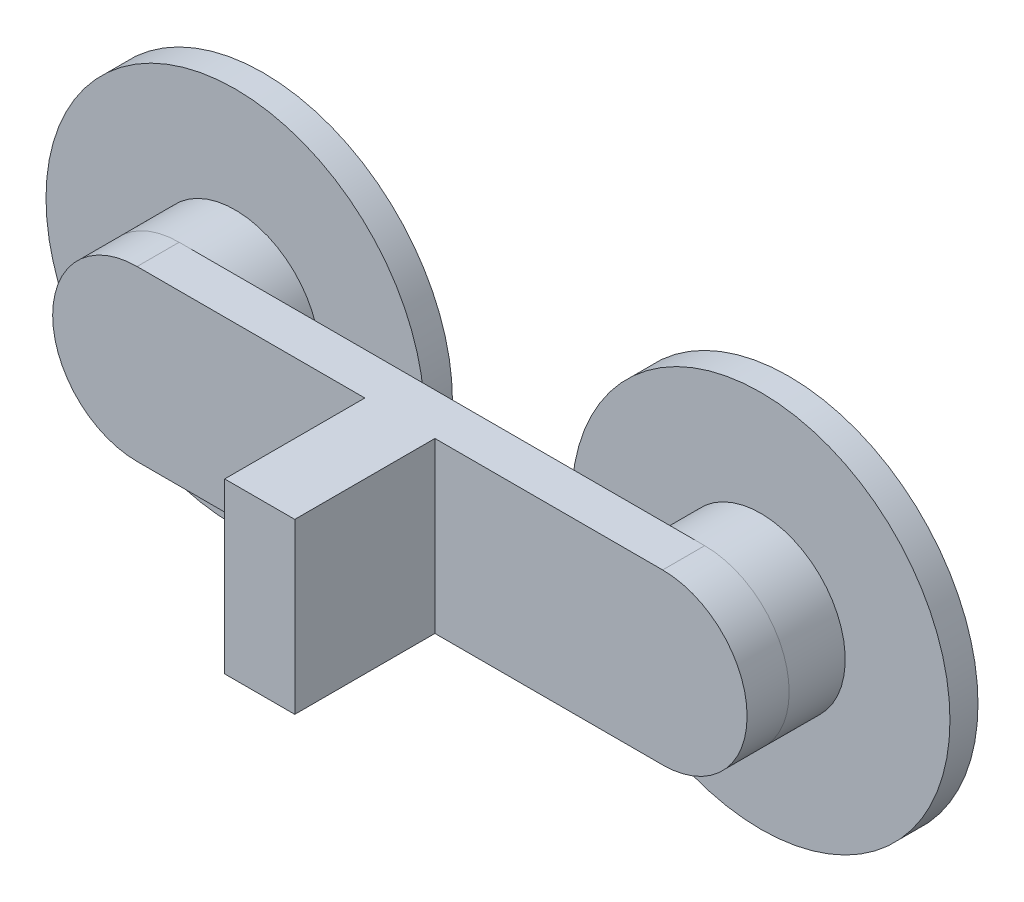
ISO-10303-21;
HEADER;
FILE_DESCRIPTION(('STEP AP214'),'2;1');
FILE_NAME('part.step','',(''),(''),'','','');
FILE_SCHEMA(('AUTOMOTIVE_DESIGN { 1 0 10303 214 1 1 1 1 }'));
ENDSEC;
DATA;
#1=APPLICATION_CONTEXT('core data for automotive mechanical design processes');
#2=APPLICATION_PROTOCOL_DEFINITION('international standard','automotive_design',2000,#1);
#3=PRODUCT_CONTEXT('',#1,'mechanical');
#4=PRODUCT('Part','Part','',(#3));
#5=PRODUCT_RELATED_PRODUCT_CATEGORY('part','',(#4));
#6=PRODUCT_DEFINITION_FORMATION('','',#4);
#7=PRODUCT_DEFINITION_CONTEXT('part definition',#1,'design');
#8=PRODUCT_DEFINITION('design','',#6,#7);
#9=PRODUCT_DEFINITION_SHAPE('','',#8);
#10=(LENGTH_UNIT() NAMED_UNIT(*) SI_UNIT(.MILLI.,.METRE.));
#11=(NAMED_UNIT(*) PLANE_ANGLE_UNIT() SI_UNIT($,.RADIAN.));
#12=(NAMED_UNIT(*) SI_UNIT($,.STERADIAN.) SOLID_ANGLE_UNIT());
#13=UNCERTAINTY_MEASURE_WITH_UNIT(LENGTH_MEASURE(1.E-05),#10,'distance_accuracy_value','');
#14=(GEOMETRIC_REPRESENTATION_CONTEXT(3) GLOBAL_UNCERTAINTY_ASSIGNED_CONTEXT((#13)) GLOBAL_UNIT_ASSIGNED_CONTEXT((#10,
#11,#12)) REPRESENTATION_CONTEXT('',''));
#15=CARTESIAN_POINT('',(0.,0.,0.));
#16=DIRECTION('',(0.,0.,1.));
#17=DIRECTION('',(1.,0.,0.));
#18=AXIS2_PLACEMENT_3D('',#15,#16,#17);
#19=CARTESIAN_POINT('',(-19.6186326528947,7.98455670782044,36.4303436753045));
#20=DIRECTION('',(0.,0.,1.));
#21=DIRECTION('',(1.,0.,0.));
#22=AXIS2_PLACEMENT_3D('',#19,#20,#21);
#23=PLANE('',#22);
#24=CARTESIAN_POINT('',(-19.6186326528947,7.98455670782044,36.4303436753045));
#25=DIRECTION('',(0.,0.,1.));
#26=DIRECTION('',(1.,0.,0.));
#27=AXIS2_PLACEMENT_3D('',#24,#25,#26);
#28=CIRCLE('',#27,6.025);
#29=CARTESIAN_POINT('',(-13.5936326528947,7.98455670782044,36.4303436753045));
#30=VERTEX_POINT('',#29);
#31=EDGE_CURVE('P0_E10',#30,#30,#28,.T.);
#32=ORIENTED_EDGE('',*,*,#31,.T.);
#33=EDGE_LOOP('',(#32));
#34=FACE_BOUND('',#33,.T.);
#35=ADVANCED_FACE('P0_F15',(#34),#23,.T.);
#36=CARTESIAN_POINT('',(-19.6186326528947,7.98455670782044,36.4303436753045));
#37=DIRECTION('',(0.,0.,-1.));
#38=DIRECTION('',(-1.,0.,0.));
#39=AXIS2_PLACEMENT_3D('',#36,#37,#38);
#40=CYLINDRICAL_SURFACE('',#39,6.025);
#41=ORIENTED_EDGE('',*,*,#31,.F.);
#42=EDGE_LOOP('',(#41));
#43=FACE_BOUND('',#42,.T.);
#44=CARTESIAN_POINT('',(-19.6186326528947,7.98455670782044,32.4303436753045));
#45=DIRECTION('',(0.,0.,-1.));
#46=DIRECTION('',(-1.,0.,0.));
#47=AXIS2_PLACEMENT_3D('',#44,#45,#46);
#48=CIRCLE('',#47,6.025);
#49=CARTESIAN_POINT('',(-25.6436326528947,7.98455670782044,32.4303436753045));
#50=VERTEX_POINT('',#49);
#51=EDGE_CURVE('P0_E22',#50,#50,#48,.T.);
#52=ORIENTED_EDGE('',*,*,#51,.F.);
#53=EDGE_LOOP('',(#52));
#54=FACE_BOUND('',#53,.T.);
#55=ADVANCED_FACE('P0_F57',(#43,#54),#40,.T.);
#56=CARTESIAN_POINT('',(-19.6186326528947,7.98455670782044,32.4303436753045));
#57=DIRECTION('',(0.,0.,-1.));
#58=DIRECTION('',(-1.,0.,0.));
#59=AXIS2_PLACEMENT_3D('',#56,#57,#58);
#60=CYLINDRICAL_SURFACE('',#59,13.5);
#61=CARTESIAN_POINT('',(-19.6186326528947,7.98455670782044,32.4303436753045));
#62=DIRECTION('',(0.,0.,-1.));
#63=DIRECTION('',(-1.,0.,0.));
#64=AXIS2_PLACEMENT_3D('',#61,#62,#63);
#65=CIRCLE('',#64,13.5);
#66=CARTESIAN_POINT('',(-33.1186326528947,7.98455670782044,32.4303436753045));
#67=VERTEX_POINT('',#66);
#68=EDGE_CURVE('P0_E26',#67,#67,#65,.T.);
#69=ORIENTED_EDGE('',*,*,#68,.T.);
#70=EDGE_LOOP('',(#69));
#71=FACE_BOUND('',#70,.T.);
#72=CARTESIAN_POINT('',(-19.6186326528947,7.98455670782044,30.4303436753045));
#73=DIRECTION('',(0.,0.,-1.));
#74=DIRECTION('',(-1.,0.,0.));
#75=AXIS2_PLACEMENT_3D('',#72,#73,#74);
#76=CIRCLE('',#75,13.5);
#77=CARTESIAN_POINT('',(-33.1186326528947,7.98455670782044,30.4303436753045));
#78=VERTEX_POINT('',#77);
#79=EDGE_CURVE('P0_E30',#78,#78,#76,.T.);
#80=ORIENTED_EDGE('',*,*,#79,.F.);
#81=EDGE_LOOP('',(#80));
#82=FACE_BOUND('',#81,.T.);
#83=ADVANCED_FACE('P0_F55',(#71,#82),#60,.T.);
#84=CARTESIAN_POINT('',(-19.6186326528947,7.98455670782044,32.4303436753045));
#85=DIRECTION('',(0.,0.,-1.));
#86=DIRECTION('',(-1.,0.,0.));
#87=AXIS2_PLACEMENT_3D('',#84,#85,#86);
#88=PLANE('',#87);
#89=ORIENTED_EDGE('',*,*,#51,.T.);
#90=EDGE_LOOP('',(#89));
#91=FACE_BOUND('',#90,.T.);
#92=ORIENTED_EDGE('',*,*,#68,.F.);
#93=EDGE_LOOP('',(#92));
#94=FACE_BOUND('',#93,.T.);
#95=ADVANCED_FACE('P0_F52',(#91,#94),#88,.F.);
#96=CARTESIAN_POINT('',(-19.6186326528947,7.98455670782044,30.4303436753045));
#97=DIRECTION('',(0.,0.,1.));
#98=DIRECTION('',(1.,0.,0.));
#99=AXIS2_PLACEMENT_3D('',#96,#97,#98);
#100=PLANE('',#99);
#101=CARTESIAN_POINT('',(-19.6186326528947,7.98455670782044,30.4303436753045));
#102=DIRECTION('',(0.,0.,-1.));
#103=DIRECTION('',(-1.,0.,0.));
#104=AXIS2_PLACEMENT_3D('',#101,#102,#103);
#105=CIRCLE('',#104,4.005);
#106=CARTESIAN_POINT('',(-23.6236326528947,7.98455670782044,30.4303436753045));
#107=VERTEX_POINT('',#106);
#108=EDGE_CURVE('P0_E36',#107,#107,#105,.T.);
#109=ORIENTED_EDGE('',*,*,#108,.F.);
#110=EDGE_LOOP('',(#109));
#111=FACE_BOUND('',#110,.T.);
#112=ORIENTED_EDGE('',*,*,#79,.T.);
#113=EDGE_LOOP('',(#112));
#114=FACE_BOUND('',#113,.T.);
#115=ADVANCED_FACE('P0_F17',(#111,#114),#100,.F.);
#116=CARTESIAN_POINT('',(-19.6186326528947,7.98455670782044,34.4303436753045));
#117=DIRECTION('',(0.,0.,-1.));
#118=DIRECTION('',(-1.,0.,0.));
#119=AXIS2_PLACEMENT_3D('',#116,#117,#118);
#120=CYLINDRICAL_SURFACE('',#119,4.005);
#121=CARTESIAN_POINT('',(-19.6186326528947,7.98455670782044,34.4303436753045));
#122=DIRECTION('',(0.,0.,-1.));
#123=DIRECTION('',(-1.,0.,0.));
#124=AXIS2_PLACEMENT_3D('',#121,#122,#123);
#125=CIRCLE('',#124,4.005);
#126=CARTESIAN_POINT('',(-23.6236326528947,7.98455670782044,34.4303436753045));
#127=VERTEX_POINT('',#126);
#128=EDGE_CURVE('P0_E34',#127,#127,#125,.T.);
#129=ORIENTED_EDGE('',*,*,#128,.F.);
#130=EDGE_LOOP('',(#129));
#131=FACE_BOUND('',#130,.T.);
#132=ORIENTED_EDGE('',*,*,#108,.T.);
#133=EDGE_LOOP('',(#132));
#134=FACE_BOUND('',#133,.T.);
#135=ADVANCED_FACE('P0_F44',(#131,#134),#120,.F.);
#136=CARTESIAN_POINT('',(-19.6186326528947,7.98455670782044,34.4303436753045));
#137=DIRECTION('',(0.,0.,-1.));
#138=DIRECTION('',(-1.,0.,0.));
#139=AXIS2_PLACEMENT_3D('',#136,#137,#138);
#140=PLANE('',#139);
#141=ORIENTED_EDGE('',*,*,#128,.T.);
#142=EDGE_LOOP('',(#141));
#143=FACE_BOUND('',#142,.T.);
#144=ADVANCED_FACE('P0_F42',(#143),#140,.T.);
#145=CLOSED_SHELL('',(#35,#55,#83,#95,#115,#135,#144));
#146=MANIFOLD_SOLID_BREP('P0_B1',#145);
#147=CARTESIAN_POINT('',(17.8813673471054,7.9845567078203,36.4303436753045));
#148=DIRECTION('',(0.,0.,1.));
#149=DIRECTION('',(1.,0.,0.));
#150=AXIS2_PLACEMENT_3D('',#147,#148,#149);
#151=PLANE('',#150);
#152=CARTESIAN_POINT('',(17.8813673471054,7.9845567078203,36.4303436753045));
#153=DIRECTION('',(0.,0.,1.));
#154=DIRECTION('',(1.,0.,0.));
#155=AXIS2_PLACEMENT_3D('',#152,#153,#154);
#156=CIRCLE('',#155,6.025);
#157=CARTESIAN_POINT('',(23.9063673471054,7.9845567078203,36.4303436753045));
#158=VERTEX_POINT('',#157);
#159=EDGE_CURVE('P1_E10',#158,#158,#156,.T.);
#160=ORIENTED_EDGE('',*,*,#159,.T.);
#161=EDGE_LOOP('',(#160));
#162=FACE_BOUND('',#161,.T.);
#163=ADVANCED_FACE('P1_F15',(#162),#151,.T.);
#164=CARTESIAN_POINT('',(17.8813673471054,7.9845567078203,36.4303436753045));
#165=DIRECTION('',(0.,0.,-1.));
#166=DIRECTION('',(-1.,0.,0.));
#167=AXIS2_PLACEMENT_3D('',#164,#165,#166);
#168=CYLINDRICAL_SURFACE('',#167,6.025);
#169=ORIENTED_EDGE('',*,*,#159,.F.);
#170=EDGE_LOOP('',(#169));
#171=FACE_BOUND('',#170,.T.);
#172=CARTESIAN_POINT('',(17.8813673471054,7.9845567078203,32.4303436753045));
#173=DIRECTION('',(0.,0.,-1.));
#174=DIRECTION('',(-1.,0.,0.));
#175=AXIS2_PLACEMENT_3D('',#172,#173,#174);
#176=CIRCLE('',#175,6.025);
#177=CARTESIAN_POINT('',(11.8563673471054,7.9845567078203,32.4303436753045));
#178=VERTEX_POINT('',#177);
#179=EDGE_CURVE('P1_E22',#178,#178,#176,.T.);
#180=ORIENTED_EDGE('',*,*,#179,.F.);
#181=EDGE_LOOP('',(#180));
#182=FACE_BOUND('',#181,.T.);
#183=ADVANCED_FACE('P1_F57',(#171,#182),#168,.T.);
#184=CARTESIAN_POINT('',(17.8813673471054,7.9845567078203,32.4303436753045));
#185=DIRECTION('',(0.,0.,-1.));
#186=DIRECTION('',(-1.,0.,0.));
#187=AXIS2_PLACEMENT_3D('',#184,#185,#186);
#188=CYLINDRICAL_SURFACE('',#187,13.5);
#189=CARTESIAN_POINT('',(17.8813673471054,7.9845567078203,32.4303436753045));
#190=DIRECTION('',(0.,0.,-1.));
#191=DIRECTION('',(-1.,0.,0.));
#192=AXIS2_PLACEMENT_3D('',#189,#190,#191);
#193=CIRCLE('',#192,13.5);
#194=CARTESIAN_POINT('',(4.38136734710541,7.9845567078203,32.4303436753045));
#195=VERTEX_POINT('',#194);
#196=EDGE_CURVE('P1_E26',#195,#195,#193,.T.);
#197=ORIENTED_EDGE('',*,*,#196,.T.);
#198=EDGE_LOOP('',(#197));
#199=FACE_BOUND('',#198,.T.);
#200=CARTESIAN_POINT('',(17.8813673471054,7.9845567078203,30.4303436753045));
#201=DIRECTION('',(0.,0.,-1.));
#202=DIRECTION('',(-1.,0.,0.));
#203=AXIS2_PLACEMENT_3D('',#200,#201,#202);
#204=CIRCLE('',#203,13.5);
#205=CARTESIAN_POINT('',(4.38136734710541,7.9845567078203,30.4303436753045));
#206=VERTEX_POINT('',#205);
#207=EDGE_CURVE('P1_E30',#206,#206,#204,.T.);
#208=ORIENTED_EDGE('',*,*,#207,.F.);
#209=EDGE_LOOP('',(#208));
#210=FACE_BOUND('',#209,.T.);
#211=ADVANCED_FACE('P1_F55',(#199,#210),#188,.T.);
#212=CARTESIAN_POINT('',(17.8813673471054,7.9845567078203,32.4303436753045));
#213=DIRECTION('',(0.,0.,-1.));
#214=DIRECTION('',(-1.,0.,0.));
#215=AXIS2_PLACEMENT_3D('',#212,#213,#214);
#216=PLANE('',#215);
#217=ORIENTED_EDGE('',*,*,#179,.T.);
#218=EDGE_LOOP('',(#217));
#219=FACE_BOUND('',#218,.T.);
#220=ORIENTED_EDGE('',*,*,#196,.F.);
#221=EDGE_LOOP('',(#220));
#222=FACE_BOUND('',#221,.T.);
#223=ADVANCED_FACE('P1_F52',(#219,#222),#216,.F.);
#224=CARTESIAN_POINT('',(17.8813673471054,7.9845567078203,30.4303436753045));
#225=DIRECTION('',(0.,0.,1.));
#226=DIRECTION('',(1.,0.,0.));
#227=AXIS2_PLACEMENT_3D('',#224,#225,#226);
#228=PLANE('',#227);
#229=CARTESIAN_POINT('',(17.8813673471054,7.9845567078203,30.4303436753045));
#230=DIRECTION('',(0.,0.,-1.));
#231=DIRECTION('',(-1.,0.,0.));
#232=AXIS2_PLACEMENT_3D('',#229,#230,#231);
#233=CIRCLE('',#232,4.005);
#234=CARTESIAN_POINT('',(13.8763673471054,7.9845567078203,30.4303436753045));
#235=VERTEX_POINT('',#234);
#236=EDGE_CURVE('P1_E36',#235,#235,#233,.T.);
#237=ORIENTED_EDGE('',*,*,#236,.F.);
#238=EDGE_LOOP('',(#237));
#239=FACE_BOUND('',#238,.T.);
#240=ORIENTED_EDGE('',*,*,#207,.T.);
#241=EDGE_LOOP('',(#240));
#242=FACE_BOUND('',#241,.T.);
#243=ADVANCED_FACE('P1_F17',(#239,#242),#228,.F.);
#244=CARTESIAN_POINT('',(17.8813673471054,7.9845567078203,34.4303436753045));
#245=DIRECTION('',(0.,0.,-1.));
#246=DIRECTION('',(-1.,0.,0.));
#247=AXIS2_PLACEMENT_3D('',#244,#245,#246);
#248=CYLINDRICAL_SURFACE('',#247,4.005);
#249=CARTESIAN_POINT('',(17.8813673471054,7.9845567078203,34.4303436753045));
#250=DIRECTION('',(0.,0.,-1.));
#251=DIRECTION('',(-1.,0.,0.));
#252=AXIS2_PLACEMENT_3D('',#249,#250,#251);
#253=CIRCLE('',#252,4.005);
#254=CARTESIAN_POINT('',(13.8763673471054,7.9845567078203,34.4303436753045));
#255=VERTEX_POINT('',#254);
#256=EDGE_CURVE('P1_E34',#255,#255,#253,.T.);
#257=ORIENTED_EDGE('',*,*,#256,.F.);
#258=EDGE_LOOP('',(#257));
#259=FACE_BOUND('',#258,.T.);
#260=ORIENTED_EDGE('',*,*,#236,.T.);
#261=EDGE_LOOP('',(#260));
#262=FACE_BOUND('',#261,.T.);
#263=ADVANCED_FACE('P1_F44',(#259,#262),#248,.F.);
#264=CARTESIAN_POINT('',(17.8813673471054,7.9845567078203,34.4303436753045));
#265=DIRECTION('',(0.,0.,-1.));
#266=DIRECTION('',(-1.,0.,0.));
#267=AXIS2_PLACEMENT_3D('',#264,#265,#266);
#268=PLANE('',#267);
#269=ORIENTED_EDGE('',*,*,#256,.T.);
#270=EDGE_LOOP('',(#269));
#271=FACE_BOUND('',#270,.T.);
#272=ADVANCED_FACE('P1_F42',(#271),#268,.T.);
#273=CLOSED_SHELL('',(#163,#183,#211,#223,#243,#263,#272));
#274=MANIFOLD_SOLID_BREP('P1_B1',#273);
#275=CARTESIAN_POINT('',(-19.6186326528947,7.98455670782044,39.4303436753045));
#276=DIRECTION('',(0.,0.,1.));
#277=DIRECTION('',(1.,0.,0.));
#278=AXIS2_PLACEMENT_3D('',#275,#276,#277);
#279=PLANE('',#278);
#280=DIRECTION('',(0.,-1.,0.));
#281=VECTOR('',#280,1.);
#282=CARTESIAN_POINT('',(-3.36863265289466,14.0095567078204,39.4303436753045));
#283=LINE('',#282,#281);
#284=CARTESIAN_POINT('',(-3.36863265289466,14.0095567078204,39.4303436753045));
#285=VERTEX_POINT('',#284);
#286=CARTESIAN_POINT('',(-3.36863265289466,1.95955670782044,39.4303436753045));
#287=VERTEX_POINT('',#286);
#288=EDGE_CURVE('P2_E31',#285,#287,#283,.T.);
#289=ORIENTED_EDGE('',*,*,#288,.F.);
#290=DIRECTION('',(-1.,0.,0.));
#291=VECTOR('',#290,1.);
#292=CARTESIAN_POINT('',(-19.6186326528947,14.0095567078204,39.4303436753045));
#293=LINE('',#292,#291);
#294=CARTESIAN_POINT('',(-19.6186326528947,14.0095567078204,39.4303436753045));
#295=VERTEX_POINT('',#294);
#296=EDGE_CURVE('P2_E120',#285,#295,#293,.T.);
#297=ORIENTED_EDGE('',*,*,#296,.T.);
#298=CARTESIAN_POINT('',(-19.6186326528947,7.98455670782044,39.4303436753045));
#299=DIRECTION('',(0.,0.,1.));
#300=DIRECTION('',(1.,0.,0.));
#301=AXIS2_PLACEMENT_3D('',#298,#299,#300);
#302=CIRCLE('',#301,6.025);
#303=CARTESIAN_POINT('',(-19.6186326528947,1.95955670782044,39.4303436753045));
#304=VERTEX_POINT('',#303);
#305=EDGE_CURVE('P2_E111',#295,#304,#302,.T.);
#306=ORIENTED_EDGE('',*,*,#305,.T.);
#307=DIRECTION('',(1.,0.,0.));
#308=VECTOR('',#307,1.);
#309=CARTESIAN_POINT('',(-19.6186326528947,1.95955670782044,39.4303436753045));
#310=LINE('',#309,#308);
#311=EDGE_CURVE('P2_E116',#304,#287,#310,.T.);
#312=ORIENTED_EDGE('',*,*,#311,.T.);
#313=EDGE_LOOP('',(#289,#297,#306,#312));
#314=FACE_BOUND('',#313,.T.);
#315=ADVANCED_FACE('P2_F16',(#314),#279,.T.);
#316=CARTESIAN_POINT('',(-19.6186326528947,7.98455670782044,39.4303436753045));
#317=DIRECTION('',(0.,0.,-1.));
#318=DIRECTION('',(-1.,0.,0.));
#319=AXIS2_PLACEMENT_3D('',#316,#317,#318);
#320=CYLINDRICAL_SURFACE('',#319,6.025);
#321=CARTESIAN_POINT('',(-19.6186326528947,7.98455670782044,36.4303436753045));
#322=DIRECTION('',(0.,0.,1.));
#323=DIRECTION('',(1.,0.,0.));
#324=AXIS2_PLACEMENT_3D('',#321,#322,#323);
#325=CIRCLE('',#324,6.025);
#326=CARTESIAN_POINT('',(-19.6186326528947,14.0095567078204,36.4303436753045));
#327=VERTEX_POINT('',#326);
#328=CARTESIAN_POINT('',(-19.6186326528947,1.95955670782044,36.4303436753045));
#329=VERTEX_POINT('',#328);
#330=EDGE_CURVE('P2_E102',#327,#329,#325,.T.);
#331=ORIENTED_EDGE('',*,*,#330,.T.);
#332=DIRECTION('',(0.,0.,-1.));
#333=VECTOR('',#332,1.);
#334=CARTESIAN_POINT('',(-19.6186326528947,1.95955670782044,39.4303436753045));
#335=LINE('',#334,#333);
#336=EDGE_CURVE('P2_E10',#304,#329,#335,.T.);
#337=ORIENTED_EDGE('',*,*,#336,.F.);
#338=ORIENTED_EDGE('',*,*,#305,.F.);
#339=DIRECTION('',(0.,0.,-1.));
#340=VECTOR('',#339,1.);
#341=CARTESIAN_POINT('',(-19.6186326528947,14.0095567078204,39.4303436753045));
#342=LINE('',#341,#340);
#343=EDGE_CURVE('P2_E122',#295,#327,#342,.T.);
#344=ORIENTED_EDGE('',*,*,#343,.T.);
#345=EDGE_LOOP('',(#331,#337,#338,#344));
#346=FACE_BOUND('',#345,.T.);
#347=ADVANCED_FACE('P2_F18',(#346),#320,.T.);
#348=CARTESIAN_POINT('',(-19.6186326528947,1.95955670782044,39.4303436753045));
#349=DIRECTION('',(0.,1.,0.));
#350=DIRECTION('',(-1.,0.,0.));
#351=AXIS2_PLACEMENT_3D('',#348,#349,#350);
#352=PLANE('',#351);
#353=DIRECTION('',(1.,0.,0.));
#354=VECTOR('',#353,1.);
#355=CARTESIAN_POINT('',(-19.6186326528947,1.95955670782044,36.4303436753045));
#356=LINE('',#355,#354);
#357=CARTESIAN_POINT('',(17.8813673471053,1.95955670782044,36.4303436753045));
#358=VERTEX_POINT('',#357);
#359=EDGE_CURVE('P2_E105',#329,#358,#356,.T.);
#360=ORIENTED_EDGE('',*,*,#359,.T.);
#361=DIRECTION('',(0.,0.,-1.));
#362=VECTOR('',#361,1.);
#363=CARTESIAN_POINT('',(17.8813673471053,1.95955670782044,39.4303436753045));
#364=LINE('',#363,#362);
#365=CARTESIAN_POINT('',(17.8813673471053,1.95955670782044,39.4303436753045));
#366=VERTEX_POINT('',#365);
#367=EDGE_CURVE('P2_E24',#366,#358,#364,.T.);
#368=ORIENTED_EDGE('',*,*,#367,.F.);
#369=CARTESIAN_POINT('',(1.63136734710534,1.95955670782044,39.4303436753045));
#370=VERTEX_POINT('',#369);
#371=EDGE_CURVE('P2_E114',#370,#366,#310,.T.);
#372=ORIENTED_EDGE('',*,*,#371,.F.);
#373=DIRECTION('',(0.,0.,-1.));
#374=VECTOR('',#373,1.);
#375=CARTESIAN_POINT('',(1.63136734710534,1.95955670782044,49.4303436753045));
#376=LINE('',#375,#374);
#377=CARTESIAN_POINT('',(1.63136734710534,1.95955670782044,49.4303436753045));
#378=VERTEX_POINT('',#377);
#379=EDGE_CURVE('P2_E87',#378,#370,#376,.T.);
#380=ORIENTED_EDGE('',*,*,#379,.F.);
#381=DIRECTION('',(1.,0.,0.));
#382=VECTOR('',#381,1.);
#383=CARTESIAN_POINT('',(-3.36863265289466,1.95955670782044,49.4303436753045));
#384=LINE('',#383,#382);
#385=CARTESIAN_POINT('',(-3.36863265289466,1.95955670782044,49.4303436753045));
#386=VERTEX_POINT('',#385);
#387=EDGE_CURVE('P2_E81',#386,#378,#384,.T.);
#388=ORIENTED_EDGE('',*,*,#387,.F.);
#389=DIRECTION('',(0.,0.,-1.));
#390=VECTOR('',#389,1.);
#391=CARTESIAN_POINT('',(-3.36863265289466,1.95955670782044,49.4303436753045));
#392=LINE('',#391,#390);
#393=EDGE_CURVE('P2_E85',#386,#287,#392,.T.);
#394=ORIENTED_EDGE('',*,*,#393,.T.);
#395=ORIENTED_EDGE('',*,*,#311,.F.);
#396=ORIENTED_EDGE('',*,*,#336,.T.);
#397=EDGE_LOOP('',(#360,#368,#372,#380,#388,#394,#395,#396));
#398=FACE_BOUND('',#397,.T.);
#399=ADVANCED_FACE('P2_F83',(#398),#352,.F.);
#400=CARTESIAN_POINT('',(17.8813673471053,7.98455670782044,39.4303436753045));
#401=DIRECTION('',(0.,0.,-1.));
#402=DIRECTION('',(-1.,0.,0.));
#403=AXIS2_PLACEMENT_3D('',#400,#401,#402);
#404=CYLINDRICAL_SURFACE('',#403,6.025);
#405=CARTESIAN_POINT('',(17.8813673471053,7.98455670782044,36.4303436753045));
#406=DIRECTION('',(0.,0.,1.));
#407=DIRECTION('',(1.,0.,0.));
#408=AXIS2_PLACEMENT_3D('',#405,#406,#407);
#409=CIRCLE('',#408,6.025);
#410=CARTESIAN_POINT('',(17.8813673471053,14.0095567078204,36.4303436753045));
#411=VERTEX_POINT('',#410);
#412=EDGE_CURVE('P2_E125',#358,#411,#409,.T.);
#413=ORIENTED_EDGE('',*,*,#412,.T.);
#414=DIRECTION('',(0.,0.,-1.));
#415=VECTOR('',#414,1.);
#416=CARTESIAN_POINT('',(17.8813673471053,14.0095567078204,39.4303436753045));
#417=LINE('',#416,#415);
#418=CARTESIAN_POINT('',(17.8813673471053,14.0095567078204,39.4303436753045));
#419=VERTEX_POINT('',#418);
#420=EDGE_CURVE('P2_E130',#419,#411,#417,.T.);
#421=ORIENTED_EDGE('',*,*,#420,.F.);
#422=CARTESIAN_POINT('',(17.8813673471053,7.98455670782044,39.4303436753045));
#423=DIRECTION('',(0.,0.,1.));
#424=DIRECTION('',(1.,0.,0.));
#425=AXIS2_PLACEMENT_3D('',#422,#423,#424);
#426=CIRCLE('',#425,6.025);
#427=EDGE_CURVE('P2_E118',#366,#419,#426,.T.);
#428=ORIENTED_EDGE('',*,*,#427,.F.);
#429=ORIENTED_EDGE('',*,*,#367,.T.);
#430=EDGE_LOOP('',(#413,#421,#428,#429));
#431=FACE_BOUND('',#430,.T.);
#432=ADVANCED_FACE('P2_F137',(#431),#404,.T.);
#433=CARTESIAN_POINT('',(-19.6186326528947,14.0095567078204,39.4303436753045));
#434=DIRECTION('',(0.,-1.,0.));
#435=DIRECTION('',(1.,0.,0.));
#436=AXIS2_PLACEMENT_3D('',#433,#434,#435);
#437=PLANE('',#436);
#438=DIRECTION('',(-1.,0.,0.));
#439=VECTOR('',#438,1.);
#440=CARTESIAN_POINT('',(-19.6186326528947,14.0095567078204,36.4303436753045));
#441=LINE('',#440,#439);
#442=EDGE_CURVE('P2_E115',#411,#327,#441,.T.);
#443=ORIENTED_EDGE('',*,*,#442,.T.);
#444=ORIENTED_EDGE('',*,*,#343,.F.);
#445=ORIENTED_EDGE('',*,*,#296,.F.);
#446=DIRECTION('',(0.,0.,-1.));
#447=VECTOR('',#446,1.);
#448=CARTESIAN_POINT('',(-3.36863265289466,14.0095567078204,49.4303436753045));
#449=LINE('',#448,#447);
#450=CARTESIAN_POINT('',(-3.36863265289466,14.0095567078204,49.4303436753045));
#451=VERTEX_POINT('',#450);
#452=EDGE_CURVE('P2_E150',#451,#285,#449,.T.);
#453=ORIENTED_EDGE('',*,*,#452,.F.);
#454=DIRECTION('',(-1.,0.,0.));
#455=VECTOR('',#454,1.);
#456=CARTESIAN_POINT('',(-3.36863265289466,14.0095567078204,49.4303436753045));
#457=LINE('',#456,#455);
#458=CARTESIAN_POINT('',(1.63136734710534,14.0095567078204,49.4303436753045));
#459=VERTEX_POINT('',#458);
#460=EDGE_CURVE('P2_E96',#459,#451,#457,.T.);
#461=ORIENTED_EDGE('',*,*,#460,.F.);
#462=DIRECTION('',(0.,0.,-1.));
#463=VECTOR('',#462,1.);
#464=CARTESIAN_POINT('',(1.63136734710534,14.0095567078204,49.4303436753045));
#465=LINE('',#464,#463);
#466=CARTESIAN_POINT('',(1.63136734710534,14.0095567078204,39.4303436753045));
#467=VERTEX_POINT('',#466);
#468=EDGE_CURVE('P2_E107',#459,#467,#465,.T.);
#469=ORIENTED_EDGE('',*,*,#468,.T.);
#470=EDGE_CURVE('P2_E121',#419,#467,#293,.T.);
#471=ORIENTED_EDGE('',*,*,#470,.F.);
#472=ORIENTED_EDGE('',*,*,#420,.T.);
#473=EDGE_LOOP('',(#443,#444,#445,#453,#461,#469,#471,#472));
#474=FACE_BOUND('',#473,.T.);
#475=ADVANCED_FACE('P2_F145',(#474),#437,.F.);
#476=DIRECTION('',(0.,1.,0.));
#477=VECTOR('',#476,1.);
#478=CARTESIAN_POINT('',(1.63136734710534,14.0095567078204,39.4303436753045));
#479=LINE('',#478,#477);
#480=EDGE_CURVE('P2_E39',#370,#467,#479,.T.);
#481=ORIENTED_EDGE('',*,*,#480,.F.);
#482=ORIENTED_EDGE('',*,*,#371,.T.);
#483=ORIENTED_EDGE('',*,*,#427,.T.);
#484=ORIENTED_EDGE('',*,*,#470,.T.);
#485=EDGE_LOOP('',(#481,#482,#483,#484));
#486=FACE_BOUND('',#485,.T.);
#487=ADVANCED_FACE('P2_F160',(#486),#279,.T.);
#488=CARTESIAN_POINT('',(-19.6186326528947,7.98455670782044,36.4303436753045));
#489=DIRECTION('',(0.,0.,1.));
#490=DIRECTION('',(1.,0.,0.));
#491=AXIS2_PLACEMENT_3D('',#488,#489,#490);
#492=PLANE('',#491);
#493=ORIENTED_EDGE('',*,*,#330,.F.);
#494=ORIENTED_EDGE('',*,*,#442,.F.);
#495=ORIENTED_EDGE('',*,*,#412,.F.);
#496=ORIENTED_EDGE('',*,*,#359,.F.);
#497=EDGE_LOOP('',(#493,#494,#495,#496));
#498=FACE_BOUND('',#497,.T.);
#499=ADVANCED_FACE('P2_F142',(#498),#492,.F.);
#500=CARTESIAN_POINT('',(-3.36863265289466,14.0095567078204,49.4303436753045));
#501=DIRECTION('',(1.,0.,0.));
#502=DIRECTION('',(0.,0.,-1.));
#503=AXIS2_PLACEMENT_3D('',#500,#501,#502);
#504=PLANE('',#503);
#505=ORIENTED_EDGE('',*,*,#288,.T.);
#506=ORIENTED_EDGE('',*,*,#393,.F.);
#507=DIRECTION('',(0.,-1.,0.));
#508=VECTOR('',#507,1.);
#509=CARTESIAN_POINT('',(-3.36863265289466,14.0095567078204,49.4303436753045));
#510=LINE('',#509,#508);
#511=EDGE_CURVE('P2_E91',#451,#386,#510,.T.);
#512=ORIENTED_EDGE('',*,*,#511,.F.);
#513=ORIENTED_EDGE('',*,*,#452,.T.);
#514=EDGE_LOOP('',(#505,#506,#512,#513));
#515=FACE_BOUND('',#514,.T.);
#516=ADVANCED_FACE('P2_F101',(#515),#504,.F.);
#517=CARTESIAN_POINT('',(1.63136734710534,14.0095567078204,49.4303436753045));
#518=DIRECTION('',(-1.,0.,0.));
#519=DIRECTION('',(0.,-1.,0.));
#520=AXIS2_PLACEMENT_3D('',#517,#518,#519);
#521=PLANE('',#520);
#522=ORIENTED_EDGE('',*,*,#480,.T.);
#523=ORIENTED_EDGE('',*,*,#468,.F.);
#524=DIRECTION('',(0.,1.,0.));
#525=VECTOR('',#524,1.);
#526=CARTESIAN_POINT('',(1.63136734710534,14.0095567078204,49.4303436753045));
#527=LINE('',#526,#525);
#528=EDGE_CURVE('P2_E90',#378,#459,#527,.T.);
#529=ORIENTED_EDGE('',*,*,#528,.F.);
#530=ORIENTED_EDGE('',*,*,#379,.T.);
#531=EDGE_LOOP('',(#522,#523,#529,#530));
#532=FACE_BOUND('',#531,.T.);
#533=ADVANCED_FACE('P2_F159',(#532),#521,.F.);
#534=CARTESIAN_POINT('',(-19.6186326528947,7.98455670782044,49.4303436753045));
#535=DIRECTION('',(0.,0.,1.));
#536=DIRECTION('',(1.,0.,0.));
#537=AXIS2_PLACEMENT_3D('',#534,#535,#536);
#538=PLANE('',#537);
#539=ORIENTED_EDGE('',*,*,#511,.T.);
#540=ORIENTED_EDGE('',*,*,#387,.T.);
#541=ORIENTED_EDGE('',*,*,#528,.T.);
#542=ORIENTED_EDGE('',*,*,#460,.T.);
#543=EDGE_LOOP('',(#539,#540,#541,#542));
#544=FACE_BOUND('',#543,.T.);
#545=ADVANCED_FACE('P2_F94',(#544),#538,.T.);
#546=CLOSED_SHELL('',(#315,#347,#399,#432,#475,#487,#499,#516,#533,#545));
#547=MANIFOLD_SOLID_BREP('P2_B1',#546);
#548=ADVANCED_BREP_SHAPE_REPRESENTATION('',(#18,#146,#274,#547),#14);
#549=SHAPE_DEFINITION_REPRESENTATION(#9,#548);
ENDSEC;
END-ISO-10303-21;
